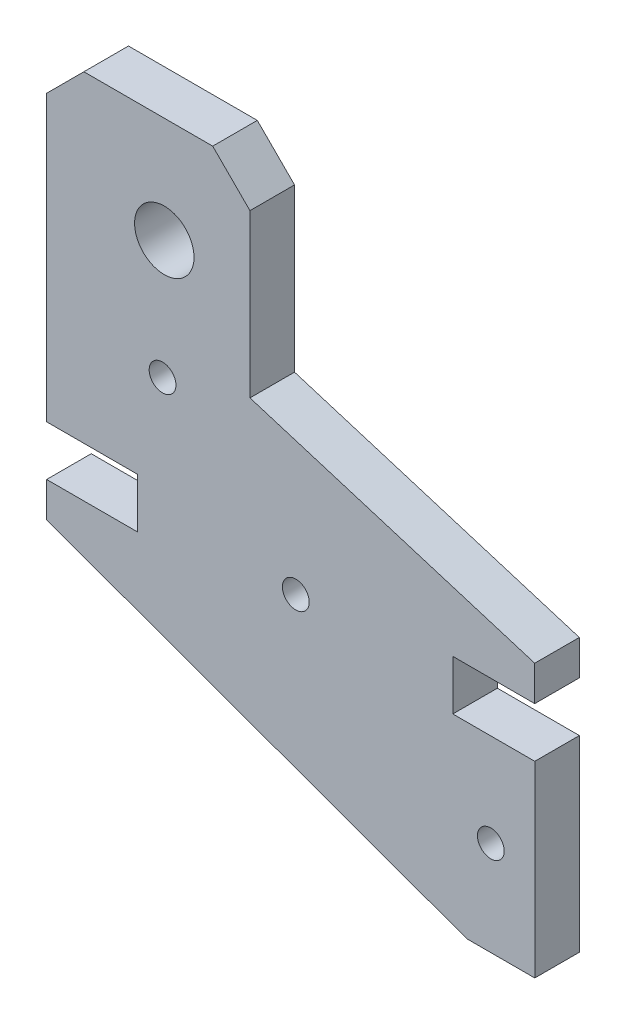
ISO-10303-21;
HEADER;
FILE_DESCRIPTION(('STEP AP214'),'2;1');
FILE_NAME('part.step','',(''),(''),'','','');
FILE_SCHEMA(('AUTOMOTIVE_DESIGN { 1 0 10303 214 1 1 1 1 }'));
ENDSEC;
DATA;
#1=APPLICATION_CONTEXT('core data for automotive mechanical design processes');
#2=APPLICATION_PROTOCOL_DEFINITION('international standard','automotive_design',2000,#1);
#3=PRODUCT_CONTEXT('',#1,'mechanical');
#4=PRODUCT('Part','Part','',(#3));
#5=PRODUCT_RELATED_PRODUCT_CATEGORY('part','',(#4));
#6=PRODUCT_DEFINITION_FORMATION('','',#4);
#7=PRODUCT_DEFINITION_CONTEXT('part definition',#1,'design');
#8=PRODUCT_DEFINITION('design','',#6,#7);
#9=PRODUCT_DEFINITION_SHAPE('','',#8);
#10=(LENGTH_UNIT() NAMED_UNIT(*) SI_UNIT(.MILLI.,.METRE.));
#11=(NAMED_UNIT(*) PLANE_ANGLE_UNIT() SI_UNIT($,.RADIAN.));
#12=(NAMED_UNIT(*) SI_UNIT($,.STERADIAN.) SOLID_ANGLE_UNIT());
#13=UNCERTAINTY_MEASURE_WITH_UNIT(LENGTH_MEASURE(1.E-05),#10,'distance_accuracy_value','');
#14=(GEOMETRIC_REPRESENTATION_CONTEXT(3) GLOBAL_UNCERTAINTY_ASSIGNED_CONTEXT((#13)) GLOBAL_UNIT_ASSIGNED_CONTEXT((#10,
#11,#12)) REPRESENTATION_CONTEXT('',''));
#15=CARTESIAN_POINT('',(0.,0.,0.));
#16=DIRECTION('',(0.,0.,1.));
#17=DIRECTION('',(1.,0.,0.));
#18=AXIS2_PLACEMENT_3D('',#15,#16,#17);
#19=CARTESIAN_POINT('',(0.,0.,6.));
#20=DIRECTION('',(0.,0.,1.));
#21=DIRECTION('',(1.,0.,0.));
#22=AXIS2_PLACEMENT_3D('',#19,#20,#21);
#23=PLANE('',#22);
#24=CARTESIAN_POINT('',(42.7121902269879,53.5764427570566,6.));
#25=DIRECTION('',(0.,0.,1.));
#26=DIRECTION('',(1.,0.,0.));
#27=AXIS2_PLACEMENT_3D('',#24,#25,#26);
#28=CIRCLE('',#27,1.8);
#29=CARTESIAN_POINT('',(44.5121902269879,53.5764427570566,6.));
#30=VERTEX_POINT('',#29);
#31=EDGE_CURVE('E360',#30,#30,#28,.T.);
#32=ORIENTED_EDGE('',*,*,#31,.F.);
#33=EDGE_LOOP('',(#32));
#34=FACE_BOUND('',#33,.T.);
#35=CARTESIAN_POINT('',(86.8807515812221,21.3717846710791,6.));
#36=DIRECTION('',(0.,0.,1.));
#37=DIRECTION('',(1.,0.,0.));
#38=AXIS2_PLACEMENT_3D('',#35,#36,#37);
#39=CIRCLE('',#38,1.8);
#40=CARTESIAN_POINT('',(88.6807515812221,21.3717846710791,6.));
#41=VERTEX_POINT('',#40);
#42=EDGE_CURVE('E193',#41,#41,#39,.T.);
#43=ORIENTED_EDGE('',*,*,#42,.F.);
#44=EDGE_LOOP('',(#43));
#45=FACE_BOUND('',#44,.T.);
#46=DIRECTION('',(-1.,0.,0.));
#47=VECTOR('',#46,1.);
#48=CARTESIAN_POINT('',(27.1156991336607,33.8944340275812,6.));
#49=LINE('',#48,#47);
#50=CARTESIAN_POINT('',(39.3386035488298,33.8944340275812,6.));
#51=VERTEX_POINT('',#50);
#52=CARTESIAN_POINT('',(27.1156991336607,33.8944340275812,6.));
#53=VERTEX_POINT('',#52);
#54=EDGE_CURVE('E222',#51,#53,#49,.T.);
#55=ORIENTED_EDGE('',*,*,#54,.T.);
#56=DIRECTION('',(1.52582562283687E-10,-1.,0.));
#57=VECTOR('',#56,1.);
#58=CARTESIAN_POINT('',(27.1156991343794,29.1836554070557,6.));
#59=LINE('',#58,#57);
#60=CARTESIAN_POINT('',(27.1156991343794,29.1836554070557,6.));
#61=VERTEX_POINT('',#60);
#62=EDGE_CURVE('E125',#53,#61,#59,.T.);
#63=ORIENTED_EDGE('',*,*,#62,.T.);
#64=DIRECTION('',(0.939932696536652,-0.341359818932074,0.));
#65=VECTOR('',#64,1.);
#66=CARTESIAN_POINT('',(83.6735665770573,8.64326622753759,6.));
#67=LINE('',#66,#65);
#68=CARTESIAN_POINT('',(83.6735665770573,8.64326622753759,6.));
#69=VERTEX_POINT('',#68);
#70=EDGE_CURVE('E264',#61,#69,#67,.T.);
#71=ORIENTED_EDGE('',*,*,#70,.T.);
#72=DIRECTION('',(1.,8.74422936522975E-10,0.));
#73=VECTOR('',#72,1.);
#74=CARTESIAN_POINT('',(92.7940010503411,8.64326623551271,6.));
#75=LINE('',#74,#73);
#76=CARTESIAN_POINT('',(92.7940010503411,8.64326623551271,6.));
#77=VERTEX_POINT('',#76);
#78=EDGE_CURVE('E283',#69,#77,#75,.T.);
#79=ORIENTED_EDGE('',*,*,#78,.T.);
#80=DIRECTION('',(0.,1.,0.));
#81=VECTOR('',#80,1.);
#82=CARTESIAN_POINT('',(92.7940010503411,33.8944340351037,6.));
#83=LINE('',#82,#81);
#84=CARTESIAN_POINT('',(92.7940010503411,33.8944340351037,6.));
#85=VERTEX_POINT('',#84);
#86=EDGE_CURVE('E280',#77,#85,#83,.T.);
#87=ORIENTED_EDGE('',*,*,#86,.T.);
#88=DIRECTION('',(-1.,-6.82063323981963E-10,0.));
#89=VECTOR('',#88,1.);
#90=CARTESIAN_POINT('',(81.7648087856495,33.8944340275811,6.));
#91=LINE('',#90,#89);
#92=CARTESIAN_POINT('',(81.7648087856495,33.8944340275811,6.));
#93=VERTEX_POINT('',#92);
#94=EDGE_CURVE('E282',#85,#93,#91,.T.);
#95=ORIENTED_EDGE('',*,*,#94,.T.);
#96=DIRECTION('',(0.,1.,0.));
#97=VECTOR('',#96,1.);
#98=CARTESIAN_POINT('',(81.7648087856494,40.609030079927,6.));
#99=LINE('',#98,#97);
#100=CARTESIAN_POINT('',(81.7648087856494,40.609030079927,6.));
#101=VERTEX_POINT('',#100);
#102=EDGE_CURVE('E285',#93,#101,#99,.T.);
#103=ORIENTED_EDGE('',*,*,#102,.T.);
#104=DIRECTION('',(1.,0.,0.));
#105=VECTOR('',#104,1.);
#106=CARTESIAN_POINT('',(92.787264170797,40.609030079927,6.));
#107=LINE('',#106,#105);
#108=CARTESIAN_POINT('',(92.787264170797,40.609030079927,6.));
#109=VERTEX_POINT('',#108);
#110=EDGE_CURVE('E291',#101,#109,#107,.T.);
#111=ORIENTED_EDGE('',*,*,#110,.T.);
#112=DIRECTION('',(0.,1.,0.));
#113=VECTOR('',#112,1.);
#114=CARTESIAN_POINT('',(92.787264170797,45.3198087031974,6.));
#115=LINE('',#114,#113);
#116=CARTESIAN_POINT('',(92.787264170797,45.3198087031974,6.));
#117=VERTEX_POINT('',#116);
#118=EDGE_CURVE('E293',#109,#117,#115,.T.);
#119=ORIENTED_EDGE('',*,*,#118,.T.);
#120=DIRECTION('',(-0.956004290458294,0.293352683003469,0.));
#121=VECTOR('',#120,1.);
#122=CARTESIAN_POINT('',(54.4725046343264,57.0768035418589,6.));
#123=LINE('',#122,#121);
#124=CARTESIAN_POINT('',(54.4725046343264,57.0768035418589,6.));
#125=VERTEX_POINT('',#124);
#126=EDGE_CURVE('E295',#117,#125,#123,.T.);
#127=ORIENTED_EDGE('',*,*,#126,.T.);
#128=DIRECTION('',(-3.40398149623492E-10,1.,0.));
#129=VECTOR('',#128,1.);
#130=CARTESIAN_POINT('',(54.4725046343264,57.0768035418589,6.));
#131=LINE('',#130,#129);
#132=CARTESIAN_POINT('',(54.4725046268996,78.895034644766,6.));
#133=VERTEX_POINT('',#132);
#134=EDGE_CURVE('E297',#125,#133,#131,.T.);
#135=ORIENTED_EDGE('',*,*,#134,.T.);
#136=DIRECTION('',(-0.707106782526774,0.707106779846321,0.));
#137=VECTOR('',#136,1.);
#138=CARTESIAN_POINT('',(49.4612768943257,83.9062623583437,6.));
#139=LINE('',#138,#137);
#140=CARTESIAN_POINT('',(49.4612768943257,83.9062623583437,6.));
#141=VERTEX_POINT('',#140);
#142=EDGE_CURVE('E299',#133,#141,#139,.T.);
#143=ORIENTED_EDGE('',*,*,#142,.T.);
#144=DIRECTION('',(-1.,-1.63883805323238E-09,0.));
#145=VECTOR('',#144,1.);
#146=CARTESIAN_POINT('',(49.4612768943257,83.9062623583437,6.));
#147=LINE('',#146,#145);
#148=CARTESIAN_POINT('',(32.1269268595263,83.9062623299355,6.));
#149=VERTEX_POINT('',#148);
#150=EDGE_CURVE('E301',#141,#149,#147,.T.);
#151=ORIENTED_EDGE('',*,*,#150,.T.);
#152=DIRECTION('',(-0.70710678118654,-0.707106781186555,0.));
#153=VECTOR('',#152,1.);
#154=CARTESIAN_POINT('',(27.1156991269528,78.8950345973619,6.));
#155=LINE('',#154,#153);
#156=CARTESIAN_POINT('',(27.1156991269528,78.8950345973619,6.));
#157=VERTEX_POINT('',#156);
#158=EDGE_CURVE('E171',#149,#157,#155,.T.);
#159=ORIENTED_EDGE('',*,*,#158,.T.);
#160=DIRECTION('',(1.93976913873457E-10,-1.,0.));
#161=VECTOR('',#160,1.);
#162=CARTESIAN_POINT('',(27.1156991343794,40.609030079927,6.));
#163=LINE('',#162,#161);
#164=CARTESIAN_POINT('',(27.1156991343794,40.609030079927,6.));
#165=VERTEX_POINT('',#164);
#166=EDGE_CURVE('E165',#157,#165,#163,.T.);
#167=ORIENTED_EDGE('',*,*,#166,.T.);
#168=DIRECTION('',(1.,0.,0.));
#169=VECTOR('',#168,1.);
#170=CARTESIAN_POINT('',(39.3386035488298,40.609030079927,6.));
#171=LINE('',#170,#169);
#172=CARTESIAN_POINT('',(39.3386035488298,40.609030079927,6.));
#173=VERTEX_POINT('',#172);
#174=EDGE_CURVE('E169',#165,#173,#171,.T.);
#175=ORIENTED_EDGE('',*,*,#174,.T.);
#176=DIRECTION('',(0.,-1.,0.));
#177=VECTOR('',#176,1.);
#178=CARTESIAN_POINT('',(39.3386035488298,33.8944340275812,6.));
#179=LINE('',#178,#177);
#180=EDGE_CURVE('E55',#173,#51,#179,.T.);
#181=ORIENTED_EDGE('',*,*,#180,.T.);
#182=EDGE_LOOP('',(#55,#63,#71,#79,#87,#95,#103,#111,#119,#127,#135,#143,#151,#159,#167,#175,#181));
#183=FACE_BOUND('',#182,.T.);
#184=CARTESIAN_POINT('',(60.6386018448299,37.2517320421783,6.));
#185=DIRECTION('',(0.,0.,1.));
#186=DIRECTION('',(1.,0.,0.));
#187=AXIS2_PLACEMENT_3D('',#184,#185,#186);
#188=CIRCLE('',#187,1.8);
#189=CARTESIAN_POINT('',(62.4386018448299,37.2517320421783,6.));
#190=VERTEX_POINT('',#189);
#191=EDGE_CURVE('E366',#190,#190,#188,.T.);
#192=ORIENTED_EDGE('',*,*,#191,.F.);
#193=EDGE_LOOP('',(#192));
#194=FACE_BOUND('',#193,.T.);
#195=CARTESIAN_POINT('',(42.9466808494069,69.6743755604792,6.));
#196=DIRECTION('',(0.,0.,1.));
#197=DIRECTION('',(1.,0.,0.));
#198=AXIS2_PLACEMENT_3D('',#195,#196,#197);
#199=CIRCLE('',#198,4.);
#200=CARTESIAN_POINT('',(46.9466808494069,69.6743755604792,6.));
#201=VERTEX_POINT('',#200);
#202=EDGE_CURVE('E351',#201,#201,#199,.T.);
#203=ORIENTED_EDGE('',*,*,#202,.F.);
#204=EDGE_LOOP('',(#203));
#205=FACE_BOUND('',#204,.T.);
#206=ADVANCED_FACE('F38',(#34,#45,#183,#194,#205),#23,.T.);
#207=CARTESIAN_POINT('',(0.,0.,0.));
#208=DIRECTION('',(0.,0.,1.));
#209=DIRECTION('',(1.,0.,0.));
#210=AXIS2_PLACEMENT_3D('',#207,#208,#209);
#211=PLANE('',#210);
#212=DIRECTION('',(-1.,0.,0.));
#213=VECTOR('',#212,1.);
#214=CARTESIAN_POINT('',(27.1156991336607,33.8944340275812,0.));
#215=LINE('',#214,#213);
#216=CARTESIAN_POINT('',(39.3386035488298,33.8944340275812,0.));
#217=VERTEX_POINT('',#216);
#218=CARTESIAN_POINT('',(27.1156991336607,33.8944340275812,0.));
#219=VERTEX_POINT('',#218);
#220=EDGE_CURVE('E189',#217,#219,#215,.T.);
#221=ORIENTED_EDGE('',*,*,#220,.F.);
#222=DIRECTION('',(0.,-1.,0.));
#223=VECTOR('',#222,1.);
#224=CARTESIAN_POINT('',(39.3386035488298,33.8944340275812,0.));
#225=LINE('',#224,#223);
#226=CARTESIAN_POINT('',(39.3386035488298,40.609030079927,0.));
#227=VERTEX_POINT('',#226);
#228=EDGE_CURVE('E117',#227,#217,#225,.T.);
#229=ORIENTED_EDGE('',*,*,#228,.F.);
#230=DIRECTION('',(1.,0.,0.));
#231=VECTOR('',#230,1.);
#232=CARTESIAN_POINT('',(39.3386035488298,40.609030079927,0.));
#233=LINE('',#232,#231);
#234=CARTESIAN_POINT('',(27.1156991343794,40.609030079927,0.));
#235=VERTEX_POINT('',#234);
#236=EDGE_CURVE('E111',#235,#227,#233,.T.);
#237=ORIENTED_EDGE('',*,*,#236,.F.);
#238=DIRECTION('',(1.93976913873457E-10,-1.,0.));
#239=VECTOR('',#238,1.);
#240=CARTESIAN_POINT('',(27.1156991343794,40.609030079927,0.));
#241=LINE('',#240,#239);
#242=CARTESIAN_POINT('',(27.1156991269528,78.8950345973619,0.));
#243=VERTEX_POINT('',#242);
#244=EDGE_CURVE('E179',#243,#235,#241,.T.);
#245=ORIENTED_EDGE('',*,*,#244,.F.);
#246=DIRECTION('',(-0.70710678118654,-0.707106781186555,0.));
#247=VECTOR('',#246,1.);
#248=CARTESIAN_POINT('',(27.1156991269528,78.8950345973619,0.));
#249=LINE('',#248,#247);
#250=CARTESIAN_POINT('',(32.1269268595263,83.9062623299355,0.));
#251=VERTEX_POINT('',#250);
#252=EDGE_CURVE('E217',#251,#243,#249,.T.);
#253=ORIENTED_EDGE('',*,*,#252,.F.);
#254=DIRECTION('',(-1.,-1.63883805323238E-09,0.));
#255=VECTOR('',#254,1.);
#256=CARTESIAN_POINT('',(49.4612768943257,83.9062623583437,0.));
#257=LINE('',#256,#255);
#258=CARTESIAN_POINT('',(49.4612768943257,83.9062623583437,0.));
#259=VERTEX_POINT('',#258);
#260=EDGE_CURVE('E215',#259,#251,#257,.T.);
#261=ORIENTED_EDGE('',*,*,#260,.F.);
#262=DIRECTION('',(-0.707106782526774,0.707106779846321,0.));
#263=VECTOR('',#262,1.);
#264=CARTESIAN_POINT('',(49.4612768943257,83.9062623583437,0.));
#265=LINE('',#264,#263);
#266=CARTESIAN_POINT('',(54.4725046268996,78.895034644766,0.));
#267=VERTEX_POINT('',#266);
#268=EDGE_CURVE('E213',#267,#259,#265,.T.);
#269=ORIENTED_EDGE('',*,*,#268,.F.);
#270=DIRECTION('',(-3.40398149623492E-10,1.,0.));
#271=VECTOR('',#270,1.);
#272=CARTESIAN_POINT('',(54.4725046343264,57.0768035418589,0.));
#273=LINE('',#272,#271);
#274=CARTESIAN_POINT('',(54.4725046343264,57.0768035418589,0.));
#275=VERTEX_POINT('',#274);
#276=EDGE_CURVE('E211',#275,#267,#273,.T.);
#277=ORIENTED_EDGE('',*,*,#276,.F.);
#278=DIRECTION('',(-0.956004290458294,0.293352683003469,0.));
#279=VECTOR('',#278,1.);
#280=CARTESIAN_POINT('',(54.4725046343264,57.0768035418589,0.));
#281=LINE('',#280,#279);
#282=CARTESIAN_POINT('',(92.787264170797,45.3198087031974,0.));
#283=VERTEX_POINT('',#282);
#284=EDGE_CURVE('E209',#283,#275,#281,.T.);
#285=ORIENTED_EDGE('',*,*,#284,.F.);
#286=DIRECTION('',(0.,1.,0.));
#287=VECTOR('',#286,1.);
#288=CARTESIAN_POINT('',(92.787264170797,45.3198087031974,0.));
#289=LINE('',#288,#287);
#290=CARTESIAN_POINT('',(92.787264170797,40.609030079927,0.));
#291=VERTEX_POINT('',#290);
#292=EDGE_CURVE('E207',#291,#283,#289,.T.);
#293=ORIENTED_EDGE('',*,*,#292,.F.);
#294=DIRECTION('',(1.,0.,0.));
#295=VECTOR('',#294,1.);
#296=CARTESIAN_POINT('',(92.787264170797,40.609030079927,0.));
#297=LINE('',#296,#295);
#298=CARTESIAN_POINT('',(81.7648087856494,40.609030079927,0.));
#299=VERTEX_POINT('',#298);
#300=EDGE_CURVE('E205',#299,#291,#297,.T.);
#301=ORIENTED_EDGE('',*,*,#300,.F.);
#302=DIRECTION('',(0.,1.,0.));
#303=VECTOR('',#302,1.);
#304=CARTESIAN_POINT('',(81.7648087856494,40.609030079927,0.));
#305=LINE('',#304,#303);
#306=CARTESIAN_POINT('',(81.7648087856495,33.8944340275811,0.));
#307=VERTEX_POINT('',#306);
#308=EDGE_CURVE('E203',#307,#299,#305,.T.);
#309=ORIENTED_EDGE('',*,*,#308,.F.);
#310=DIRECTION('',(-1.,-6.82063323981963E-10,0.));
#311=VECTOR('',#310,1.);
#312=CARTESIAN_POINT('',(81.7648087856495,33.8944340275811,0.));
#313=LINE('',#312,#311);
#314=CARTESIAN_POINT('',(92.7940010503411,33.8944340351037,0.));
#315=VERTEX_POINT('',#314);
#316=EDGE_CURVE('E201',#315,#307,#313,.T.);
#317=ORIENTED_EDGE('',*,*,#316,.F.);
#318=DIRECTION('',(0.,1.,0.));
#319=VECTOR('',#318,1.);
#320=CARTESIAN_POINT('',(92.7940010503411,33.8944340351037,0.));
#321=LINE('',#320,#319);
#322=CARTESIAN_POINT('',(92.7940010503411,8.64326623551271,0.));
#323=VERTEX_POINT('',#322);
#324=EDGE_CURVE('E199',#323,#315,#321,.T.);
#325=ORIENTED_EDGE('',*,*,#324,.F.);
#326=DIRECTION('',(1.,8.74422936522975E-10,0.));
#327=VECTOR('',#326,1.);
#328=CARTESIAN_POINT('',(92.7940010503411,8.64326623551271,0.));
#329=LINE('',#328,#327);
#330=CARTESIAN_POINT('',(83.6735665770573,8.64326622753759,0.));
#331=VERTEX_POINT('',#330);
#332=EDGE_CURVE('E197',#331,#323,#329,.T.);
#333=ORIENTED_EDGE('',*,*,#332,.F.);
#334=DIRECTION('',(0.939932696536652,-0.341359818932074,0.));
#335=VECTOR('',#334,1.);
#336=CARTESIAN_POINT('',(83.6735665770573,8.64326622753759,0.));
#337=LINE('',#336,#335);
#338=CARTESIAN_POINT('',(27.1156991343794,29.1836554070557,0.));
#339=VERTEX_POINT('',#338);
#340=EDGE_CURVE('E195',#339,#331,#337,.T.);
#341=ORIENTED_EDGE('',*,*,#340,.F.);
#342=DIRECTION('',(1.52582562283687E-10,-1.,0.));
#343=VECTOR('',#342,1.);
#344=CARTESIAN_POINT('',(27.1156991343794,29.1836554070557,0.));
#345=LINE('',#344,#343);
#346=EDGE_CURVE('E192',#219,#339,#345,.T.);
#347=ORIENTED_EDGE('',*,*,#346,.F.);
#348=EDGE_LOOP('',(#221,#229,#237,#245,#253,#261,#269,#277,#285,#293,#301,#309,#317,#325,#333,
#341,#347));
#349=FACE_BOUND('',#348,.T.);
#350=CARTESIAN_POINT('',(86.8807515812221,21.3717846710791,0.));
#351=DIRECTION('',(0.,0.,1.));
#352=DIRECTION('',(1.,0.,0.));
#353=AXIS2_PLACEMENT_3D('',#350,#351,#352);
#354=CIRCLE('',#353,1.8);
#355=CARTESIAN_POINT('',(88.6807515812221,21.3717846710791,0.));
#356=VERTEX_POINT('',#355);
#357=EDGE_CURVE('E369',#356,#356,#354,.T.);
#358=ORIENTED_EDGE('',*,*,#357,.T.);
#359=EDGE_LOOP('',(#358));
#360=FACE_BOUND('',#359,.T.);
#361=CARTESIAN_POINT('',(60.6386018448299,37.2517320421783,0.));
#362=DIRECTION('',(0.,0.,1.));
#363=DIRECTION('',(1.,0.,0.));
#364=AXIS2_PLACEMENT_3D('',#361,#362,#363);
#365=CIRCLE('',#364,1.8);
#366=CARTESIAN_POINT('',(62.4386018448299,37.2517320421783,0.));
#367=VERTEX_POINT('',#366);
#368=EDGE_CURVE('E363',#367,#367,#365,.T.);
#369=ORIENTED_EDGE('',*,*,#368,.T.);
#370=EDGE_LOOP('',(#369));
#371=FACE_BOUND('',#370,.T.);
#372=CARTESIAN_POINT('',(42.7121902269879,53.5764427570566,0.));
#373=DIRECTION('',(0.,0.,1.));
#374=DIRECTION('',(1.,0.,0.));
#375=AXIS2_PLACEMENT_3D('',#372,#373,#374);
#376=CIRCLE('',#375,1.8);
#377=CARTESIAN_POINT('',(44.5121902269879,53.5764427570566,0.));
#378=VERTEX_POINT('',#377);
#379=EDGE_CURVE('E357',#378,#378,#376,.T.);
#380=ORIENTED_EDGE('',*,*,#379,.T.);
#381=EDGE_LOOP('',(#380));
#382=FACE_BOUND('',#381,.T.);
#383=CARTESIAN_POINT('',(42.9466808494069,69.6743755604792,0.));
#384=DIRECTION('',(0.,0.,1.));
#385=DIRECTION('',(1.,0.,0.));
#386=AXIS2_PLACEMENT_3D('',#383,#384,#385);
#387=CIRCLE('',#386,4.);
#388=CARTESIAN_POINT('',(46.9466808494069,69.6743755604792,0.));
#389=VERTEX_POINT('',#388);
#390=EDGE_CURVE('E354',#389,#389,#387,.T.);
#391=ORIENTED_EDGE('',*,*,#390,.T.);
#392=EDGE_LOOP('',(#391));
#393=FACE_BOUND('',#392,.T.);
#394=ADVANCED_FACE('F268',(#349,#360,#371,#382,#393),#211,.F.);
#395=CARTESIAN_POINT('',(27.1156991336607,33.8944340275812,6.));
#396=DIRECTION('',(0.,-1.,0.));
#397=DIRECTION('',(0.,0.,-1.));
#398=AXIS2_PLACEMENT_3D('',#395,#396,#397);
#399=PLANE('',#398);
#400=ORIENTED_EDGE('',*,*,#220,.T.);
#401=DIRECTION('',(0.,0.,-1.));
#402=VECTOR('',#401,1.);
#403=CARTESIAN_POINT('',(27.1156991336607,33.8944340275812,6.));
#404=LINE('',#403,#402);
#405=EDGE_CURVE('E11',#53,#219,#404,.T.);
#406=ORIENTED_EDGE('',*,*,#405,.F.);
#407=ORIENTED_EDGE('',*,*,#54,.F.);
#408=DIRECTION('',(0.,0.,-1.));
#409=VECTOR('',#408,1.);
#410=CARTESIAN_POINT('',(39.3386035488298,33.8944340275812,6.));
#411=LINE('',#410,#409);
#412=EDGE_CURVE('E185',#51,#217,#411,.T.);
#413=ORIENTED_EDGE('',*,*,#412,.T.);
#414=EDGE_LOOP('',(#400,#406,#407,#413));
#415=FACE_BOUND('',#414,.T.);
#416=ADVANCED_FACE('F40',(#415),#399,.F.);
#417=CARTESIAN_POINT('',(27.1156991343794,29.1836554070557,6.));
#418=DIRECTION('',(1.,1.52582562283687E-10,0.));
#419=DIRECTION('',(-1.52582562283687E-10,1.,0.));
#420=AXIS2_PLACEMENT_3D('',#417,#418,#419);
#421=PLANE('',#420);
#422=ORIENTED_EDGE('',*,*,#346,.T.);
#423=DIRECTION('',(0.,0.,-1.));
#424=VECTOR('',#423,1.);
#425=CARTESIAN_POINT('',(27.1156991343794,29.1836554070557,6.));
#426=LINE('',#425,#424);
#427=EDGE_CURVE('E47',#61,#339,#426,.T.);
#428=ORIENTED_EDGE('',*,*,#427,.F.);
#429=ORIENTED_EDGE('',*,*,#62,.F.);
#430=ORIENTED_EDGE('',*,*,#405,.T.);
#431=EDGE_LOOP('',(#422,#428,#429,#430));
#432=FACE_BOUND('',#431,.T.);
#433=ADVANCED_FACE('F529',(#432),#421,.F.);
#434=CARTESIAN_POINT('',(83.6735665770573,8.64326622753759,6.));
#435=DIRECTION('',(0.341359818932074,0.939932696536652,0.));
#436=DIRECTION('',(-0.939932696536652,0.341359818932074,0.));
#437=AXIS2_PLACEMENT_3D('',#434,#435,#436);
#438=PLANE('',#437);
#439=ORIENTED_EDGE('',*,*,#340,.T.);
#440=DIRECTION('',(0.,0.,-1.));
#441=VECTOR('',#440,1.);
#442=CARTESIAN_POINT('',(83.6735665770573,8.64326622753759,6.));
#443=LINE('',#442,#441);
#444=EDGE_CURVE('E256',#69,#331,#443,.T.);
#445=ORIENTED_EDGE('',*,*,#444,.F.);
#446=ORIENTED_EDGE('',*,*,#70,.F.);
#447=ORIENTED_EDGE('',*,*,#427,.T.);
#448=EDGE_LOOP('',(#439,#445,#446,#447));
#449=FACE_BOUND('',#448,.T.);
#450=ADVANCED_FACE('F262',(#449),#438,.F.);
#451=CARTESIAN_POINT('',(92.7940010503411,8.64326623551271,6.));
#452=DIRECTION('',(-8.74422936522975E-10,1.,0.));
#453=DIRECTION('',(-1.,-8.74422936522975E-10,0.));
#454=AXIS2_PLACEMENT_3D('',#451,#452,#453);
#455=PLANE('',#454);
#456=ORIENTED_EDGE('',*,*,#332,.T.);
#457=DIRECTION('',(0.,0.,-1.));
#458=VECTOR('',#457,1.);
#459=CARTESIAN_POINT('',(92.7940010503411,8.64326623551271,6.));
#460=LINE('',#459,#458);
#461=EDGE_CURVE('E253',#77,#323,#460,.T.);
#462=ORIENTED_EDGE('',*,*,#461,.F.);
#463=ORIENTED_EDGE('',*,*,#78,.F.);
#464=ORIENTED_EDGE('',*,*,#444,.T.);
#465=EDGE_LOOP('',(#456,#462,#463,#464));
#466=FACE_BOUND('',#465,.T.);
#467=ADVANCED_FACE('F274',(#466),#455,.F.);
#468=CARTESIAN_POINT('',(92.7940010503411,33.8944340351037,6.));
#469=DIRECTION('',(-1.,0.,0.));
#470=DIRECTION('',(0.,0.,1.));
#471=AXIS2_PLACEMENT_3D('',#468,#469,#470);
#472=PLANE('',#471);
#473=ORIENTED_EDGE('',*,*,#324,.T.);
#474=DIRECTION('',(0.,0.,-1.));
#475=VECTOR('',#474,1.);
#476=CARTESIAN_POINT('',(92.7940010503411,33.8944340351037,6.));
#477=LINE('',#476,#475);
#478=EDGE_CURVE('E250',#85,#315,#477,.T.);
#479=ORIENTED_EDGE('',*,*,#478,.F.);
#480=ORIENTED_EDGE('',*,*,#86,.F.);
#481=ORIENTED_EDGE('',*,*,#461,.T.);
#482=EDGE_LOOP('',(#473,#479,#480,#481));
#483=FACE_BOUND('',#482,.T.);
#484=ADVANCED_FACE('F278',(#483),#472,.F.);
#485=CARTESIAN_POINT('',(81.7648087856495,33.8944340275811,6.));
#486=DIRECTION('',(6.82063323981963E-10,-1.,0.));
#487=DIRECTION('',(1.,6.82063323981963E-10,0.));
#488=AXIS2_PLACEMENT_3D('',#485,#486,#487);
#489=PLANE('',#488);
#490=ORIENTED_EDGE('',*,*,#316,.T.);
#491=DIRECTION('',(0.,0.,-1.));
#492=VECTOR('',#491,1.);
#493=CARTESIAN_POINT('',(81.7648087856495,33.8944340275811,6.));
#494=LINE('',#493,#492);
#495=EDGE_CURVE('E247',#93,#307,#494,.T.);
#496=ORIENTED_EDGE('',*,*,#495,.F.);
#497=ORIENTED_EDGE('',*,*,#94,.F.);
#498=ORIENTED_EDGE('',*,*,#478,.T.);
#499=EDGE_LOOP('',(#490,#496,#497,#498));
#500=FACE_BOUND('',#499,.T.);
#501=ADVANCED_FACE('F494',(#500),#489,.F.);
#502=CARTESIAN_POINT('',(81.7648087856494,40.609030079927,6.));
#503=DIRECTION('',(-1.,0.,0.));
#504=DIRECTION('',(0.,-1.,0.));
#505=AXIS2_PLACEMENT_3D('',#502,#503,#504);
#506=PLANE('',#505);
#507=ORIENTED_EDGE('',*,*,#308,.T.);
#508=DIRECTION('',(0.,0.,-1.));
#509=VECTOR('',#508,1.);
#510=CARTESIAN_POINT('',(81.7648087856494,40.609030079927,6.));
#511=LINE('',#510,#509);
#512=EDGE_CURVE('E244',#101,#299,#511,.T.);
#513=ORIENTED_EDGE('',*,*,#512,.F.);
#514=ORIENTED_EDGE('',*,*,#102,.F.);
#515=ORIENTED_EDGE('',*,*,#495,.T.);
#516=EDGE_LOOP('',(#507,#513,#514,#515));
#517=FACE_BOUND('',#516,.T.);
#518=ADVANCED_FACE('F484',(#517),#506,.F.);
#519=CARTESIAN_POINT('',(92.787264170797,40.609030079927,6.));
#520=DIRECTION('',(0.,1.,0.));
#521=DIRECTION('',(0.,0.,1.));
#522=AXIS2_PLACEMENT_3D('',#519,#520,#521);
#523=PLANE('',#522);
#524=ORIENTED_EDGE('',*,*,#300,.T.);
#525=DIRECTION('',(0.,0.,-1.));
#526=VECTOR('',#525,1.);
#527=CARTESIAN_POINT('',(92.787264170797,40.609030079927,6.));
#528=LINE('',#527,#526);
#529=EDGE_CURVE('E241',#109,#291,#528,.T.);
#530=ORIENTED_EDGE('',*,*,#529,.F.);
#531=ORIENTED_EDGE('',*,*,#110,.F.);
#532=ORIENTED_EDGE('',*,*,#512,.T.);
#533=EDGE_LOOP('',(#524,#530,#531,#532));
#534=FACE_BOUND('',#533,.T.);
#535=ADVANCED_FACE('F474',(#534),#523,.F.);
#536=CARTESIAN_POINT('',(92.787264170797,45.3198087031974,6.));
#537=DIRECTION('',(-1.,0.,0.));
#538=DIRECTION('',(0.,0.,1.));
#539=AXIS2_PLACEMENT_3D('',#536,#537,#538);
#540=PLANE('',#539);
#541=ORIENTED_EDGE('',*,*,#292,.T.);
#542=DIRECTION('',(0.,0.,-1.));
#543=VECTOR('',#542,1.);
#544=CARTESIAN_POINT('',(92.787264170797,45.3198087031974,6.));
#545=LINE('',#544,#543);
#546=EDGE_CURVE('E238',#117,#283,#545,.T.);
#547=ORIENTED_EDGE('',*,*,#546,.F.);
#548=ORIENTED_EDGE('',*,*,#118,.F.);
#549=ORIENTED_EDGE('',*,*,#529,.T.);
#550=EDGE_LOOP('',(#541,#547,#548,#549));
#551=FACE_BOUND('',#550,.T.);
#552=ADVANCED_FACE('F464',(#551),#540,.F.);
#553=CARTESIAN_POINT('',(54.4725046343264,57.0768035418589,6.));
#554=DIRECTION('',(-0.293352683003469,-0.956004290458294,0.));
#555=DIRECTION('',(0.956004290458294,-0.293352683003469,0.));
#556=AXIS2_PLACEMENT_3D('',#553,#554,#555);
#557=PLANE('',#556);
#558=ORIENTED_EDGE('',*,*,#284,.T.);
#559=DIRECTION('',(0.,0.,-1.));
#560=VECTOR('',#559,1.);
#561=CARTESIAN_POINT('',(54.4725046343264,57.0768035418589,6.));
#562=LINE('',#561,#560);
#563=EDGE_CURVE('E235',#125,#275,#562,.T.);
#564=ORIENTED_EDGE('',*,*,#563,.F.);
#565=ORIENTED_EDGE('',*,*,#126,.F.);
#566=ORIENTED_EDGE('',*,*,#546,.T.);
#567=EDGE_LOOP('',(#558,#564,#565,#566));
#568=FACE_BOUND('',#567,.T.);
#569=ADVANCED_FACE('F454',(#568),#557,.F.);
#570=CARTESIAN_POINT('',(54.4725046343264,57.0768035418589,6.));
#571=DIRECTION('',(-1.,-3.40398149623492E-10,0.));
#572=DIRECTION('',(3.40398149623492E-10,-1.,0.));
#573=AXIS2_PLACEMENT_3D('',#570,#571,#572);
#574=PLANE('',#573);
#575=ORIENTED_EDGE('',*,*,#276,.T.);
#576=DIRECTION('',(0.,0.,-1.));
#577=VECTOR('',#576,1.);
#578=CARTESIAN_POINT('',(54.4725046268996,78.895034644766,6.));
#579=LINE('',#578,#577);
#580=EDGE_CURVE('E232',#133,#267,#579,.T.);
#581=ORIENTED_EDGE('',*,*,#580,.F.);
#582=ORIENTED_EDGE('',*,*,#134,.F.);
#583=ORIENTED_EDGE('',*,*,#563,.T.);
#584=EDGE_LOOP('',(#575,#581,#582,#583));
#585=FACE_BOUND('',#584,.T.);
#586=ADVANCED_FACE('F444',(#585),#574,.F.);
#587=CARTESIAN_POINT('',(49.4612768943257,83.9062623583437,6.));
#588=DIRECTION('',(-0.707106779846321,-0.707106782526774,0.));
#589=DIRECTION('',(0.707106782526774,-0.707106779846321,0.));
#590=AXIS2_PLACEMENT_3D('',#587,#588,#589);
#591=PLANE('',#590);
#592=ORIENTED_EDGE('',*,*,#268,.T.);
#593=DIRECTION('',(0.,0.,-1.));
#594=VECTOR('',#593,1.);
#595=CARTESIAN_POINT('',(49.4612768943257,83.9062623583437,6.));
#596=LINE('',#595,#594);
#597=EDGE_CURVE('E229',#141,#259,#596,.T.);
#598=ORIENTED_EDGE('',*,*,#597,.F.);
#599=ORIENTED_EDGE('',*,*,#142,.F.);
#600=ORIENTED_EDGE('',*,*,#580,.T.);
#601=EDGE_LOOP('',(#592,#598,#599,#600));
#602=FACE_BOUND('',#601,.T.);
#603=ADVANCED_FACE('F435',(#602),#591,.F.);
#604=CARTESIAN_POINT('',(49.4612768943257,83.9062623583437,6.));
#605=DIRECTION('',(1.63883805323238E-09,-1.,0.));
#606=DIRECTION('',(1.,1.63883805323238E-09,0.));
#607=AXIS2_PLACEMENT_3D('',#604,#605,#606);
#608=PLANE('',#607);
#609=ORIENTED_EDGE('',*,*,#260,.T.);
#610=DIRECTION('',(0.,0.,-1.));
#611=VECTOR('',#610,1.);
#612=CARTESIAN_POINT('',(32.1269268595263,83.9062623299355,6.));
#613=LINE('',#612,#611);
#614=EDGE_CURVE('E226',#149,#251,#613,.T.);
#615=ORIENTED_EDGE('',*,*,#614,.F.);
#616=ORIENTED_EDGE('',*,*,#150,.F.);
#617=ORIENTED_EDGE('',*,*,#597,.T.);
#618=EDGE_LOOP('',(#609,#615,#616,#617));
#619=FACE_BOUND('',#618,.T.);
#620=ADVANCED_FACE('F307',(#619),#608,.F.);
#621=CARTESIAN_POINT('',(27.1156991269528,78.8950345973619,6.));
#622=DIRECTION('',(0.707106781186555,-0.70710678118654,0.));
#623=DIRECTION('',(0.70710678118654,0.707106781186555,0.));
#624=AXIS2_PLACEMENT_3D('',#621,#622,#623);
#625=PLANE('',#624);
#626=ORIENTED_EDGE('',*,*,#252,.T.);
#627=DIRECTION('',(0.,0.,-1.));
#628=VECTOR('',#627,1.);
#629=CARTESIAN_POINT('',(27.1156991269528,78.8950345973619,6.));
#630=LINE('',#629,#628);
#631=EDGE_CURVE('E180',#157,#243,#630,.T.);
#632=ORIENTED_EDGE('',*,*,#631,.F.);
#633=ORIENTED_EDGE('',*,*,#158,.F.);
#634=ORIENTED_EDGE('',*,*,#614,.T.);
#635=EDGE_LOOP('',(#626,#632,#633,#634));
#636=FACE_BOUND('',#635,.T.);
#637=ADVANCED_FACE('F311',(#636),#625,.F.);
#638=CARTESIAN_POINT('',(27.1156991343794,40.609030079927,6.));
#639=DIRECTION('',(1.,1.93976913873457E-10,0.));
#640=DIRECTION('',(-1.93976913873457E-10,1.,0.));
#641=AXIS2_PLACEMENT_3D('',#638,#639,#640);
#642=PLANE('',#641);
#643=ORIENTED_EDGE('',*,*,#244,.T.);
#644=DIRECTION('',(0.,0.,-1.));
#645=VECTOR('',#644,1.);
#646=CARTESIAN_POINT('',(27.1156991343794,40.609030079927,6.));
#647=LINE('',#646,#645);
#648=EDGE_CURVE('E176',#165,#235,#647,.T.);
#649=ORIENTED_EDGE('',*,*,#648,.F.);
#650=ORIENTED_EDGE('',*,*,#166,.F.);
#651=ORIENTED_EDGE('',*,*,#631,.T.);
#652=EDGE_LOOP('',(#643,#649,#650,#651));
#653=FACE_BOUND('',#652,.T.);
#654=ADVANCED_FACE('F177',(#653),#642,.F.);
#655=CARTESIAN_POINT('',(39.3386035488298,40.609030079927,6.));
#656=DIRECTION('',(0.,1.,0.));
#657=DIRECTION('',(0.,0.,1.));
#658=AXIS2_PLACEMENT_3D('',#655,#656,#657);
#659=PLANE('',#658);
#660=ORIENTED_EDGE('',*,*,#236,.T.);
#661=DIRECTION('',(0.,0.,-1.));
#662=VECTOR('',#661,1.);
#663=CARTESIAN_POINT('',(39.3386035488298,40.609030079927,6.));
#664=LINE('',#663,#662);
#665=EDGE_CURVE('E181',#173,#227,#664,.T.);
#666=ORIENTED_EDGE('',*,*,#665,.F.);
#667=ORIENTED_EDGE('',*,*,#174,.F.);
#668=ORIENTED_EDGE('',*,*,#648,.T.);
#669=EDGE_LOOP('',(#660,#666,#667,#668));
#670=FACE_BOUND('',#669,.T.);
#671=ADVANCED_FACE('F183',(#670),#659,.F.);
#672=CARTESIAN_POINT('',(39.3386035488298,33.8944340275812,6.));
#673=DIRECTION('',(1.,0.,0.));
#674=DIRECTION('',(0.,0.,-1.));
#675=AXIS2_PLACEMENT_3D('',#672,#673,#674);
#676=PLANE('',#675);
#677=ORIENTED_EDGE('',*,*,#228,.T.);
#678=ORIENTED_EDGE('',*,*,#412,.F.);
#679=ORIENTED_EDGE('',*,*,#180,.F.);
#680=ORIENTED_EDGE('',*,*,#665,.T.);
#681=EDGE_LOOP('',(#677,#678,#679,#680));
#682=FACE_BOUND('',#681,.T.);
#683=ADVANCED_FACE('F315',(#682),#676,.F.);
#684=CARTESIAN_POINT('',(86.8807515812221,21.3717846710791,6.));
#685=DIRECTION('',(0.,0.,-1.));
#686=DIRECTION('',(-1.,0.,0.));
#687=AXIS2_PLACEMENT_3D('',#684,#685,#686);
#688=CYLINDRICAL_SURFACE('',#687,1.8);
#689=ORIENTED_EDGE('',*,*,#42,.T.);
#690=EDGE_LOOP('',(#689));
#691=FACE_BOUND('',#690,.T.);
#692=ORIENTED_EDGE('',*,*,#357,.F.);
#693=EDGE_LOOP('',(#692));
#694=FACE_BOUND('',#693,.T.);
#695=ADVANCED_FACE('F317',(#691,#694),#688,.F.);
#696=CARTESIAN_POINT('',(60.6386018448299,37.2517320421783,6.));
#697=DIRECTION('',(0.,0.,-1.));
#698=DIRECTION('',(-1.,0.,0.));
#699=AXIS2_PLACEMENT_3D('',#696,#697,#698);
#700=CYLINDRICAL_SURFACE('',#699,1.8);
#701=ORIENTED_EDGE('',*,*,#191,.T.);
#702=EDGE_LOOP('',(#701));
#703=FACE_BOUND('',#702,.T.);
#704=ORIENTED_EDGE('',*,*,#368,.F.);
#705=EDGE_LOOP('',(#704));
#706=FACE_BOUND('',#705,.T.);
#707=ADVANCED_FACE('F323',(#703,#706),#700,.F.);
#708=CARTESIAN_POINT('',(42.7121902269879,53.5764427570566,6.));
#709=DIRECTION('',(0.,0.,-1.));
#710=DIRECTION('',(-1.,0.,0.));
#711=AXIS2_PLACEMENT_3D('',#708,#709,#710);
#712=CYLINDRICAL_SURFACE('',#711,1.8);
#713=ORIENTED_EDGE('',*,*,#31,.T.);
#714=EDGE_LOOP('',(#713));
#715=FACE_BOUND('',#714,.T.);
#716=ORIENTED_EDGE('',*,*,#379,.F.);
#717=EDGE_LOOP('',(#716));
#718=FACE_BOUND('',#717,.T.);
#719=ADVANCED_FACE('F338',(#715,#718),#712,.F.);
#720=CARTESIAN_POINT('',(42.9466808494069,69.6743755604792,6.));
#721=DIRECTION('',(0.,0.,-1.));
#722=DIRECTION('',(-1.,0.,0.));
#723=AXIS2_PLACEMENT_3D('',#720,#721,#722);
#724=CYLINDRICAL_SURFACE('',#723,4.);
#725=ORIENTED_EDGE('',*,*,#202,.T.);
#726=EDGE_LOOP('',(#725));
#727=FACE_BOUND('',#726,.T.);
#728=ORIENTED_EDGE('',*,*,#390,.F.);
#729=EDGE_LOOP('',(#728));
#730=FACE_BOUND('',#729,.T.);
#731=ADVANCED_FACE('F342',(#727,#730),#724,.F.);
#732=CLOSED_SHELL('',(#206,#394,#416,#433,#450,#467,#484,#501,#518,#535,#552,#569,#586,#603,
#620,#637,#654,#671,#683,#695,#707,#719,#731));
#733=MANIFOLD_SOLID_BREP('B2',#732);
#734=ADVANCED_BREP_SHAPE_REPRESENTATION('',(#18,#733),#14);
#735=SHAPE_DEFINITION_REPRESENTATION(#9,#734);
ENDSEC;
END-ISO-10303-21;
